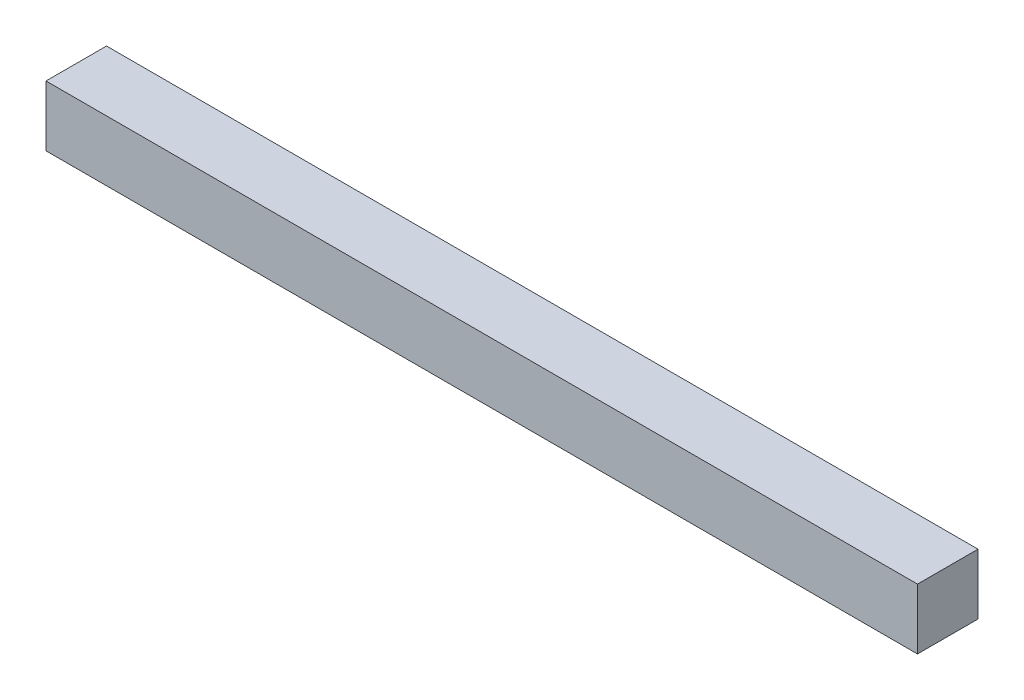
ISO-10303-21;
HEADER;
FILE_DESCRIPTION(('STEP AP214'),'2;1');
FILE_NAME('part.step','',(''),(''),'','','');
FILE_SCHEMA(('AUTOMOTIVE_DESIGN { 1 0 10303 214 1 1 1 1 }'));
ENDSEC;
DATA;
#1=APPLICATION_CONTEXT('core data for automotive mechanical design processes');
#2=APPLICATION_PROTOCOL_DEFINITION('international standard','automotive_design',2000,#1);
#3=PRODUCT_CONTEXT('',#1,'mechanical');
#4=PRODUCT('Part','Part','',(#3));
#5=PRODUCT_RELATED_PRODUCT_CATEGORY('part','',(#4));
#6=PRODUCT_DEFINITION_FORMATION('','',#4);
#7=PRODUCT_DEFINITION_CONTEXT('part definition',#1,'design');
#8=PRODUCT_DEFINITION('design','',#6,#7);
#9=PRODUCT_DEFINITION_SHAPE('','',#8);
#10=(LENGTH_UNIT() NAMED_UNIT(*) SI_UNIT(.MILLI.,.METRE.));
#11=(NAMED_UNIT(*) PLANE_ANGLE_UNIT() SI_UNIT($,.RADIAN.));
#12=(NAMED_UNIT(*) SI_UNIT($,.STERADIAN.) SOLID_ANGLE_UNIT());
#13=UNCERTAINTY_MEASURE_WITH_UNIT(LENGTH_MEASURE(1.E-05),#10,'distance_accuracy_value','');
#14=(GEOMETRIC_REPRESENTATION_CONTEXT(3) GLOBAL_UNCERTAINTY_ASSIGNED_CONTEXT((#13)) GLOBAL_UNIT_ASSIGNED_CONTEXT((#10,
#11,#12)) REPRESENTATION_CONTEXT('',''));
#15=CARTESIAN_POINT('',(0.,0.,0.));
#16=DIRECTION('',(0.,0.,1.));
#17=DIRECTION('',(1.,0.,0.));
#18=AXIS2_PLACEMENT_3D('',#15,#16,#17);
#19=CARTESIAN_POINT('',(1.33226762955019E-12,25.4000000000001,2.22044604925031E-13));
#20=DIRECTION('',(1.,0.,0.));
#21=DIRECTION('',(0.,0.,-1.));
#22=AXIS2_PLACEMENT_3D('',#19,#20,#21);
#23=PLANE('',#22);
#24=DIRECTION('',(0.,0.,1.));
#25=VECTOR('',#24,1.);
#26=CARTESIAN_POINT('',(0.,0.,0.));
#27=LINE('',#26,#25);
#28=CARTESIAN_POINT('',(2.22044604925031E-12,-3.33066907387547E-13,-25.4000000000003));
#29=VERTEX_POINT('',#28);
#30=CARTESIAN_POINT('',(0.,0.,0.));
#31=VERTEX_POINT('',#30);
#32=EDGE_CURVE('E97',#29,#31,#27,.T.);
#33=ORIENTED_EDGE('',*,*,#32,.T.);
#34=DIRECTION('',(0.,-0.999999999999996,0.));
#35=VECTOR('',#34,1.);
#36=CARTESIAN_POINT('',(1.33226762955019E-12,25.4000000000001,2.22044604925031E-13));
#37=LINE('',#36,#35);
#38=CARTESIAN_POINT('',(1.33226762955019E-12,25.4000000000001,2.22044604925031E-13));
#39=VERTEX_POINT('',#38);
#40=EDGE_CURVE('E11',#39,#31,#37,.T.);
#41=ORIENTED_EDGE('',*,*,#40,.F.);
#42=DIRECTION('',(0.,0.,1.));
#43=VECTOR('',#42,1.);
#44=CARTESIAN_POINT('',(1.33226762955019E-12,25.4000000000001,2.22044604925031E-13));
#45=LINE('',#44,#43);
#46=CARTESIAN_POINT('',(2.22044604925031E-12,25.4000000000006,-25.4000000000003));
#47=VERTEX_POINT('',#46);
#48=EDGE_CURVE('E85',#47,#39,#45,.T.);
#49=ORIENTED_EDGE('',*,*,#48,.F.);
#50=DIRECTION('',(0.,-0.999999999999996,0.));
#51=VECTOR('',#50,1.);
#52=CARTESIAN_POINT('',(2.22044604925031E-12,25.4000000000006,-25.4000000000003));
#53=LINE('',#52,#51);
#54=EDGE_CURVE('E93',#47,#29,#53,.T.);
#55=ORIENTED_EDGE('',*,*,#54,.T.);
#56=EDGE_LOOP('',(#33,#41,#49,#55));
#57=FACE_BOUND('',#56,.T.);
#58=ADVANCED_FACE('F34',(#57),#23,.F.);
#59=CARTESIAN_POINT('',(1.33226762955019E-12,25.4000000000001,2.22044604925031E-13));
#60=DIRECTION('',(0.,0.,-1.));
#61=DIRECTION('',(-1.,0.,0.));
#62=AXIS2_PLACEMENT_3D('',#59,#60,#61);
#63=PLANE('',#62);
#64=DIRECTION('',(1.,0.,0.));
#65=VECTOR('',#64,1.);
#66=CARTESIAN_POINT('',(0.,0.,0.));
#67=LINE('',#66,#65);
#68=CARTESIAN_POINT('',(365.760000000003,7.7715611723761E-13,4.44089209850063E-13));
#69=VERTEX_POINT('',#68);
#70=EDGE_CURVE('E89',#31,#69,#67,.T.);
#71=ORIENTED_EDGE('',*,*,#70,.T.);
#72=DIRECTION('',(0.,-0.999999999999996,0.));
#73=VECTOR('',#72,1.);
#74=CARTESIAN_POINT('',(365.760000000002,25.4000000000001,0.));
#75=LINE('',#74,#73);
#76=CARTESIAN_POINT('',(365.760000000002,25.4000000000001,0.));
#77=VERTEX_POINT('',#76);
#78=EDGE_CURVE('E42',#77,#69,#75,.T.);
#79=ORIENTED_EDGE('',*,*,#78,.F.);
#80=DIRECTION('',(1.,0.,0.));
#81=VECTOR('',#80,1.);
#82=CARTESIAN_POINT('',(1.33226762955019E-12,25.4000000000001,2.22044604925031E-13));
#83=LINE('',#82,#81);
#84=EDGE_CURVE('E80',#39,#77,#83,.T.);
#85=ORIENTED_EDGE('',*,*,#84,.F.);
#86=ORIENTED_EDGE('',*,*,#40,.T.);
#87=EDGE_LOOP('',(#71,#79,#85,#86));
#88=FACE_BOUND('',#87,.T.);
#89=ADVANCED_FACE('F88',(#88),#63,.F.);
#90=CARTESIAN_POINT('',(365.760000000002,25.4000000000001,0.));
#91=DIRECTION('',(-1.,0.,0.));
#92=DIRECTION('',(0.,0.,1.));
#93=AXIS2_PLACEMENT_3D('',#90,#91,#92);
#94=PLANE('',#93);
#95=DIRECTION('',(0.,0.,-1.));
#96=VECTOR('',#95,1.);
#97=CARTESIAN_POINT('',(365.760000000003,7.7715611723761E-13,4.44089209850063E-13));
#98=LINE('',#97,#96);
#99=CARTESIAN_POINT('',(365.760000000002,2.22044604925031E-13,-25.4000000000003));
#100=VERTEX_POINT('',#99);
#101=EDGE_CURVE('E67',#69,#100,#98,.T.);
#102=ORIENTED_EDGE('',*,*,#101,.T.);
#103=DIRECTION('',(0.,-0.999999999999996,0.));
#104=VECTOR('',#103,1.);
#105=CARTESIAN_POINT('',(365.760000000002,25.4000000000003,-25.3999999999994));
#106=LINE('',#105,#104);
#107=CARTESIAN_POINT('',(365.760000000002,25.4000000000003,-25.3999999999994));
#108=VERTEX_POINT('',#107);
#109=EDGE_CURVE('E90',#108,#100,#106,.T.);
#110=ORIENTED_EDGE('',*,*,#109,.F.);
#111=DIRECTION('',(0.,0.,-1.));
#112=VECTOR('',#111,1.);
#113=CARTESIAN_POINT('',(365.760000000002,25.4000000000001,0.));
#114=LINE('',#113,#112);
#115=EDGE_CURVE('E83',#77,#108,#114,.T.);
#116=ORIENTED_EDGE('',*,*,#115,.F.);
#117=ORIENTED_EDGE('',*,*,#78,.T.);
#118=EDGE_LOOP('',(#102,#110,#116,#117));
#119=FACE_BOUND('',#118,.T.);
#120=ADVANCED_FACE('F91',(#119),#94,.F.);
#121=CARTESIAN_POINT('',(2.22044604925031E-12,25.4000000000006,-25.4000000000003));
#122=DIRECTION('',(0.,0.,1.));
#123=DIRECTION('',(1.,0.,0.));
#124=AXIS2_PLACEMENT_3D('',#121,#122,#123);
#125=PLANE('',#124);
#126=DIRECTION('',(-1.,0.,0.));
#127=VECTOR('',#126,1.);
#128=CARTESIAN_POINT('',(2.22044604925031E-12,-3.33066907387547E-13,-25.4000000000003));
#129=LINE('',#128,#127);
#130=EDGE_CURVE('E73',#100,#29,#129,.T.);
#131=ORIENTED_EDGE('',*,*,#130,.T.);
#132=ORIENTED_EDGE('',*,*,#54,.F.);
#133=DIRECTION('',(-1.,0.,0.));
#134=VECTOR('',#133,1.);
#135=CARTESIAN_POINT('',(2.22044604925031E-12,25.4000000000006,-25.4000000000003));
#136=LINE('',#135,#134);
#137=EDGE_CURVE('E50',#108,#47,#136,.T.);
#138=ORIENTED_EDGE('',*,*,#137,.F.);
#139=ORIENTED_EDGE('',*,*,#109,.T.);
#140=EDGE_LOOP('',(#131,#132,#138,#139));
#141=FACE_BOUND('',#140,.T.);
#142=ADVANCED_FACE('F104',(#141),#125,.F.);
#143=CARTESIAN_POINT('',(1.33226762955019E-12,25.4000000000001,2.22044604925031E-13));
#144=DIRECTION('',(0.,-0.999999999999996,0.));
#145=DIRECTION('',(0.,0.,-1.));
#146=AXIS2_PLACEMENT_3D('',#143,#144,#145);
#147=PLANE('',#146);
#148=ORIENTED_EDGE('',*,*,#48,.T.);
#149=ORIENTED_EDGE('',*,*,#84,.T.);
#150=ORIENTED_EDGE('',*,*,#115,.T.);
#151=ORIENTED_EDGE('',*,*,#137,.T.);
#152=EDGE_LOOP('',(#148,#149,#150,#151));
#153=FACE_BOUND('',#152,.T.);
#154=ADVANCED_FACE('F81',(#153),#147,.F.);
#155=CARTESIAN_POINT('',(0.,0.,0.));
#156=DIRECTION('',(0.,-0.999999999999996,0.));
#157=DIRECTION('',(0.,0.,-1.));
#158=AXIS2_PLACEMENT_3D('',#155,#156,#157);
#159=PLANE('',#158);
#160=ORIENTED_EDGE('',*,*,#32,.F.);
#161=ORIENTED_EDGE('',*,*,#130,.F.);
#162=ORIENTED_EDGE('',*,*,#101,.F.);
#163=ORIENTED_EDGE('',*,*,#70,.F.);
#164=EDGE_LOOP('',(#160,#161,#162,#163));
#165=FACE_BOUND('',#164,.T.);
#166=ADVANCED_FACE('F107',(#165),#159,.T.);
#167=CLOSED_SHELL('',(#58,#89,#120,#142,#154,#166));
#168=MANIFOLD_SOLID_BREP('B2',#167);
#169=ADVANCED_BREP_SHAPE_REPRESENTATION('',(#18,#168),#14);
#170=SHAPE_DEFINITION_REPRESENTATION(#9,#169);
ENDSEC;
END-ISO-10303-21;
